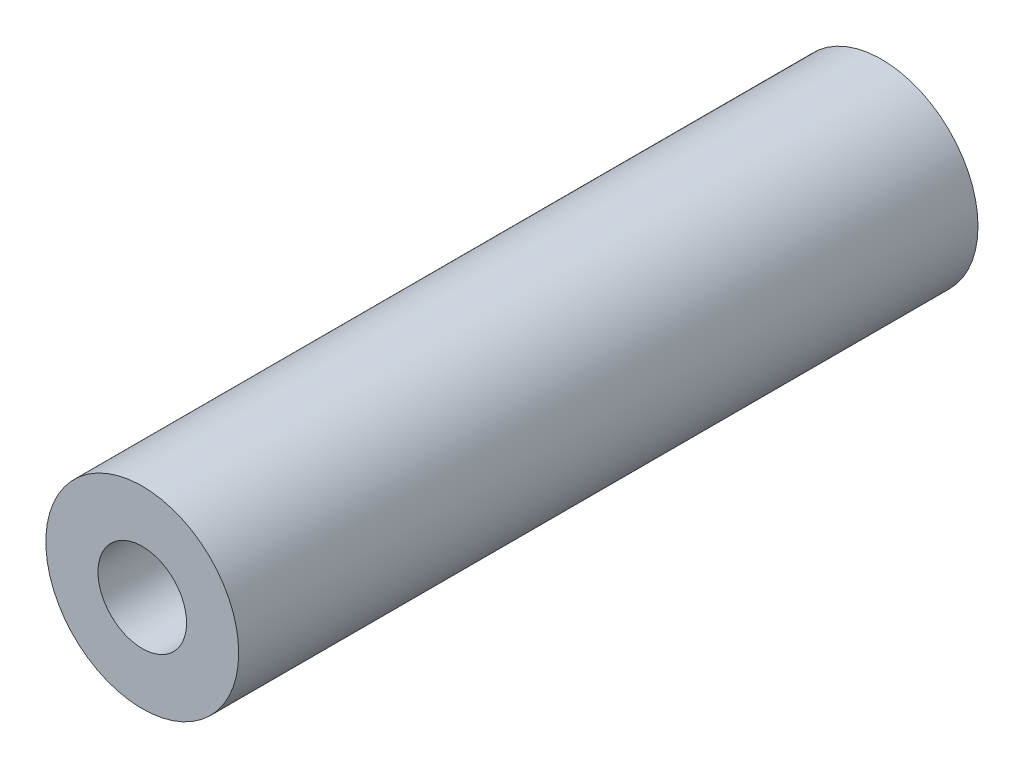
ISO-10303-21;
HEADER;
FILE_DESCRIPTION(('STEP AP214'),'2;1');
FILE_NAME('part.step','',(''),(''),'','','');
FILE_SCHEMA(('AUTOMOTIVE_DESIGN { 1 0 10303 214 1 1 1 1 }'));
ENDSEC;
DATA;
#1=APPLICATION_CONTEXT('core data for automotive mechanical design processes');
#2=APPLICATION_PROTOCOL_DEFINITION('international standard','automotive_design',2000,#1);
#3=PRODUCT_CONTEXT('',#1,'mechanical');
#4=PRODUCT('Part','Part','',(#3));
#5=PRODUCT_RELATED_PRODUCT_CATEGORY('part','',(#4));
#6=PRODUCT_DEFINITION_FORMATION('','',#4);
#7=PRODUCT_DEFINITION_CONTEXT('part definition',#1,'design');
#8=PRODUCT_DEFINITION('design','',#6,#7);
#9=PRODUCT_DEFINITION_SHAPE('','',#8);
#10=(LENGTH_UNIT() NAMED_UNIT(*) SI_UNIT(.MILLI.,.METRE.));
#11=(NAMED_UNIT(*) PLANE_ANGLE_UNIT() SI_UNIT($,.RADIAN.));
#12=(NAMED_UNIT(*) SI_UNIT($,.STERADIAN.) SOLID_ANGLE_UNIT());
#13=UNCERTAINTY_MEASURE_WITH_UNIT(LENGTH_MEASURE(1.E-05),#10,'distance_accuracy_value','');
#14=(GEOMETRIC_REPRESENTATION_CONTEXT(3) GLOBAL_UNCERTAINTY_ASSIGNED_CONTEXT((#13)) GLOBAL_UNIT_ASSIGNED_CONTEXT((#10,
#11,#12)) REPRESENTATION_CONTEXT('',''));
#15=CARTESIAN_POINT('',(0.,0.,0.));
#16=DIRECTION('',(0.,0.,1.));
#17=DIRECTION('',(1.,0.,0.));
#18=AXIS2_PLACEMENT_3D('',#15,#16,#17);
#19=CARTESIAN_POINT('',(0.,0.,292.1));
#20=DIRECTION('',(0.,0.,-1.));
#21=DIRECTION('',(-1.,0.,0.));
#22=AXIS2_PLACEMENT_3D('',#19,#20,#21);
#23=CYLINDRICAL_SURFACE('',#22,38.1);
#24=CARTESIAN_POINT('',(0.,0.,292.1));
#25=DIRECTION('',(0.,0.,1.));
#26=DIRECTION('',(1.,0.,0.));
#27=AXIS2_PLACEMENT_3D('',#24,#25,#26);
#28=CIRCLE('',#27,38.1);
#29=CARTESIAN_POINT('',(38.1,0.,292.1));
#30=VERTEX_POINT('',#29);
#31=EDGE_CURVE('E10',#30,#30,#28,.T.);
#32=ORIENTED_EDGE('',*,*,#31,.F.);
#33=EDGE_LOOP('',(#32));
#34=FACE_BOUND('',#33,.T.);
#35=CARTESIAN_POINT('',(0.,0.,0.));
#36=DIRECTION('',(0.,0.,1.));
#37=DIRECTION('',(1.,0.,0.));
#38=AXIS2_PLACEMENT_3D('',#35,#36,#37);
#39=CIRCLE('',#38,38.1);
#40=CARTESIAN_POINT('',(38.1,0.,0.));
#41=VERTEX_POINT('',#40);
#42=EDGE_CURVE('E43',#41,#41,#39,.T.);
#43=ORIENTED_EDGE('',*,*,#42,.T.);
#44=EDGE_LOOP('',(#43));
#45=FACE_BOUND('',#44,.T.);
#46=ADVANCED_FACE('F40',(#34,#45),#23,.T.);
#47=CARTESIAN_POINT('',(0.,0.,292.1));
#48=DIRECTION('',(0.,0.,1.));
#49=DIRECTION('',(1.,0.,0.));
#50=AXIS2_PLACEMENT_3D('',#47,#48,#49);
#51=PLANE('',#50);
#52=CARTESIAN_POINT('',(0.,0.,292.1));
#53=DIRECTION('',(0.,0.,1.));
#54=DIRECTION('',(1.,0.,0.));
#55=AXIS2_PLACEMENT_3D('',#52,#53,#54);
#56=CIRCLE('',#55,17.5);
#57=CARTESIAN_POINT('',(17.5,0.,292.1));
#58=VERTEX_POINT('',#57);
#59=EDGE_CURVE('E53',#58,#58,#56,.T.);
#60=ORIENTED_EDGE('',*,*,#59,.F.);
#61=EDGE_LOOP('',(#60));
#62=FACE_BOUND('',#61,.T.);
#63=ORIENTED_EDGE('',*,*,#31,.T.);
#64=EDGE_LOOP('',(#63));
#65=FACE_BOUND('',#64,.T.);
#66=ADVANCED_FACE('F74',(#62,#65),#51,.T.);
#67=CARTESIAN_POINT('',(0.,0.,0.));
#68=DIRECTION('',(0.,0.,1.));
#69=DIRECTION('',(1.,0.,0.));
#70=AXIS2_PLACEMENT_3D('',#67,#68,#69);
#71=PLANE('',#70);
#72=CARTESIAN_POINT('',(0.,0.,0.));
#73=DIRECTION('',(0.,0.,1.));
#74=DIRECTION('',(1.,0.,0.));
#75=AXIS2_PLACEMENT_3D('',#72,#73,#74);
#76=CIRCLE('',#75,17.5);
#77=CARTESIAN_POINT('',(17.5,0.,0.));
#78=VERTEX_POINT('',#77);
#79=EDGE_CURVE('E58',#78,#78,#76,.T.);
#80=ORIENTED_EDGE('',*,*,#79,.T.);
#81=EDGE_LOOP('',(#80));
#82=FACE_BOUND('',#81,.T.);
#83=ORIENTED_EDGE('',*,*,#42,.F.);
#84=EDGE_LOOP('',(#83));
#85=FACE_BOUND('',#84,.T.);
#86=ADVANCED_FACE('F64',(#82,#85),#71,.F.);
#87=CARTESIAN_POINT('',(0.,0.,0.));
#88=DIRECTION('',(0.,0.,1.));
#89=DIRECTION('',(1.,0.,0.));
#90=AXIS2_PLACEMENT_3D('',#87,#88,#89);
#91=CYLINDRICAL_SURFACE('',#90,17.5);
#92=ORIENTED_EDGE('',*,*,#59,.T.);
#93=EDGE_LOOP('',(#92));
#94=FACE_BOUND('',#93,.T.);
#95=ORIENTED_EDGE('',*,*,#79,.F.);
#96=EDGE_LOOP('',(#95));
#97=FACE_BOUND('',#96,.T.);
#98=ADVANCED_FACE('F67',(#94,#97),#91,.F.);
#99=CLOSED_SHELL('',(#46,#66,#86,#98));
#100=MANIFOLD_SOLID_BREP('B2',#99);
#101=ADVANCED_BREP_SHAPE_REPRESENTATION('',(#18,#100),#14);
#102=SHAPE_DEFINITION_REPRESENTATION(#9,#101);
ENDSEC;
END-ISO-10303-21;
